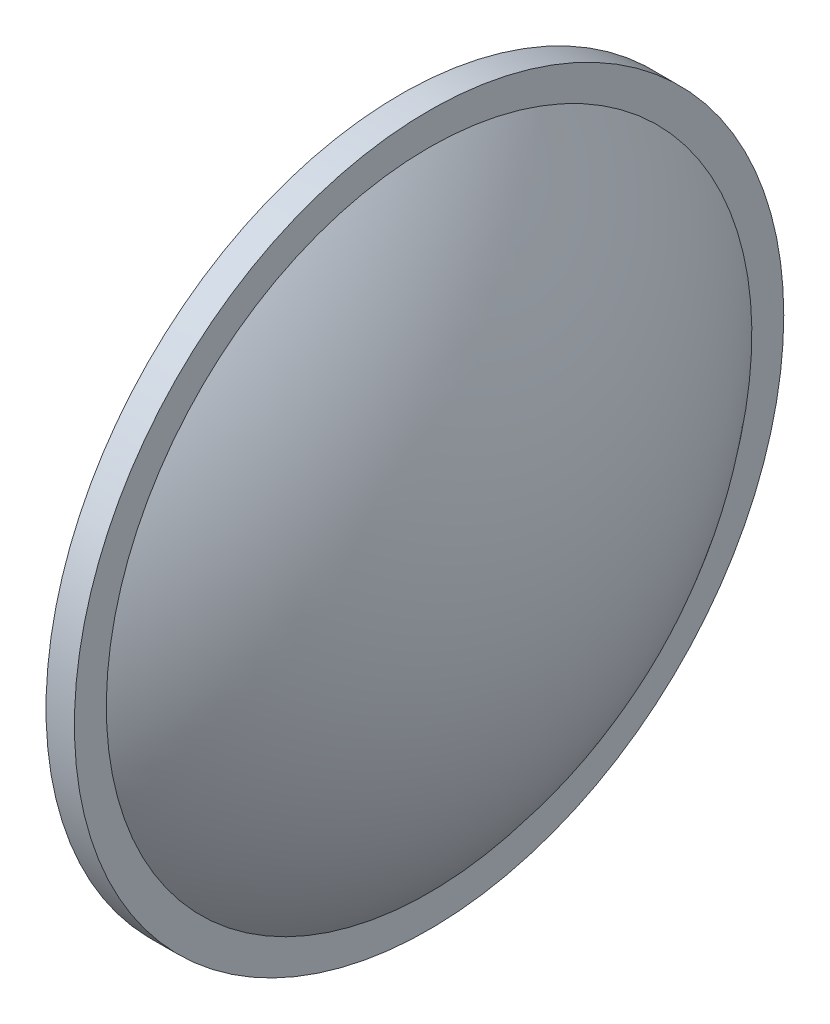
ISO-10303-21;
HEADER;
FILE_DESCRIPTION(('STEP AP214'),'2;1');
FILE_NAME('part.step','',(''),(''),'','','');
FILE_SCHEMA(('AUTOMOTIVE_DESIGN { 1 0 10303 214 1 1 1 1 }'));
ENDSEC;
DATA;
#1=APPLICATION_CONTEXT('core data for automotive mechanical design processes');
#2=APPLICATION_PROTOCOL_DEFINITION('international standard','automotive_design',2000,#1);
#3=PRODUCT_CONTEXT('',#1,'mechanical');
#4=PRODUCT('Part','Part','',(#3));
#5=PRODUCT_RELATED_PRODUCT_CATEGORY('part','',(#4));
#6=PRODUCT_DEFINITION_FORMATION('','',#4);
#7=PRODUCT_DEFINITION_CONTEXT('part definition',#1,'design');
#8=PRODUCT_DEFINITION('design','',#6,#7);
#9=PRODUCT_DEFINITION_SHAPE('','',#8);
#10=(LENGTH_UNIT() NAMED_UNIT(*) SI_UNIT(.MILLI.,.METRE.));
#11=(NAMED_UNIT(*) PLANE_ANGLE_UNIT() SI_UNIT($,.RADIAN.));
#12=(NAMED_UNIT(*) SI_UNIT($,.STERADIAN.) SOLID_ANGLE_UNIT());
#13=UNCERTAINTY_MEASURE_WITH_UNIT(LENGTH_MEASURE(1.E-05),#10,'distance_accuracy_value','');
#14=(GEOMETRIC_REPRESENTATION_CONTEXT(3) GLOBAL_UNCERTAINTY_ASSIGNED_CONTEXT((#13)) GLOBAL_UNIT_ASSIGNED_CONTEXT((#10,
#11,#12)) REPRESENTATION_CONTEXT('',''));
#15=CARTESIAN_POINT('',(0.,0.,0.));
#16=DIRECTION('',(0.,0.,1.));
#17=DIRECTION('',(1.,0.,0.));
#18=AXIS2_PLACEMENT_3D('',#15,#16,#17);
#19=CARTESIAN_POINT('',(4.,0.,0.));
#20=DIRECTION('',(-1.,0.,0.));
#21=DIRECTION('',(0.,0.,1.));
#22=AXIS2_PLACEMENT_3D('',#19,#20,#21);
#23=CYLINDRICAL_SURFACE('',#22,50.);
#24=CARTESIAN_POINT('',(4.,0.,0.));
#25=DIRECTION('',(1.,0.,0.));
#26=DIRECTION('',(0.,0.,-1.));
#27=AXIS2_PLACEMENT_3D('',#24,#25,#26);
#28=CIRCLE('',#27,50.);
#29=CARTESIAN_POINT('',(4.,0.,-50.));
#30=VERTEX_POINT('',#29);
#31=EDGE_CURVE('E12',#30,#30,#28,.T.);
#32=ORIENTED_EDGE('',*,*,#31,.F.);
#33=EDGE_LOOP('',(#32));
#34=FACE_BOUND('',#33,.T.);
#35=CARTESIAN_POINT('',(0.,0.,0.));
#36=DIRECTION('',(1.,0.,0.));
#37=DIRECTION('',(0.,0.,-1.));
#38=AXIS2_PLACEMENT_3D('',#35,#36,#37);
#39=CIRCLE('',#38,50.);
#40=CARTESIAN_POINT('',(0.,0.,-50.));
#41=VERTEX_POINT('',#40);
#42=EDGE_CURVE('E56',#41,#41,#39,.T.);
#43=ORIENTED_EDGE('',*,*,#42,.T.);
#44=EDGE_LOOP('',(#43));
#45=FACE_BOUND('',#44,.T.);
#46=ADVANCED_FACE('F53',(#34,#45),#23,.T.);
#47=CARTESIAN_POINT('',(4.,0.,0.));
#48=DIRECTION('',(1.,0.,0.));
#49=DIRECTION('',(0.,0.,-1.));
#50=AXIS2_PLACEMENT_3D('',#47,#48,#49);
#51=PLANE('',#50);
#52=CARTESIAN_POINT('',(4.,0.,0.));
#53=DIRECTION('',(1.,0.,0.));
#54=DIRECTION('',(0.,1.,0.));
#55=AXIS2_PLACEMENT_3D('',#52,#53,#54);
#56=CIRCLE('',#55,45.5);
#57=CARTESIAN_POINT('',(4.,45.5,0.));
#58=VERTEX_POINT('',#57);
#59=EDGE_CURVE('E63',#58,#58,#56,.T.);
#60=ORIENTED_EDGE('',*,*,#59,.F.);
#61=EDGE_LOOP('',(#60));
#62=FACE_BOUND('',#61,.T.);
#63=ORIENTED_EDGE('',*,*,#31,.T.);
#64=EDGE_LOOP('',(#63));
#65=FACE_BOUND('',#64,.T.);
#66=ADVANCED_FACE('F70',(#62,#65),#51,.T.);
#67=CARTESIAN_POINT('',(0.,0.,0.));
#68=DIRECTION('',(1.,0.,0.));
#69=DIRECTION('',(0.,0.,-1.));
#70=AXIS2_PLACEMENT_3D('',#67,#68,#69);
#71=PLANE('',#70);
#72=ORIENTED_EDGE('',*,*,#42,.F.);
#73=EDGE_LOOP('',(#72));
#74=FACE_BOUND('',#73,.T.);
#75=ADVANCED_FACE('F72',(#74),#71,.F.);
#76=CARTESIAN_POINT('',(-49.6335329341318,0.,0.));
#77=DIRECTION('',(1.,0.,0.));
#78=DIRECTION('',(0.,1.,0.));
#79=AXIS2_PLACEMENT_3D('',#76,#77,#78);
#80=SPHERICAL_SURFACE('',#79,70.3335329341318);
#81=ORIENTED_EDGE('',*,*,#59,.T.);
#82=EDGE_LOOP('',(#81));
#83=FACE_BOUND('',#82,.T.);
#84=ADVANCED_FACE('F68',(#83),#80,.T.);
#85=CLOSED_SHELL('',(#46,#66,#75,#84));
#86=MANIFOLD_SOLID_BREP('B2',#85);
#87=ADVANCED_BREP_SHAPE_REPRESENTATION('',(#18,#86),#14);
#88=SHAPE_DEFINITION_REPRESENTATION(#9,#87);
ENDSEC;
END-ISO-10303-21;
